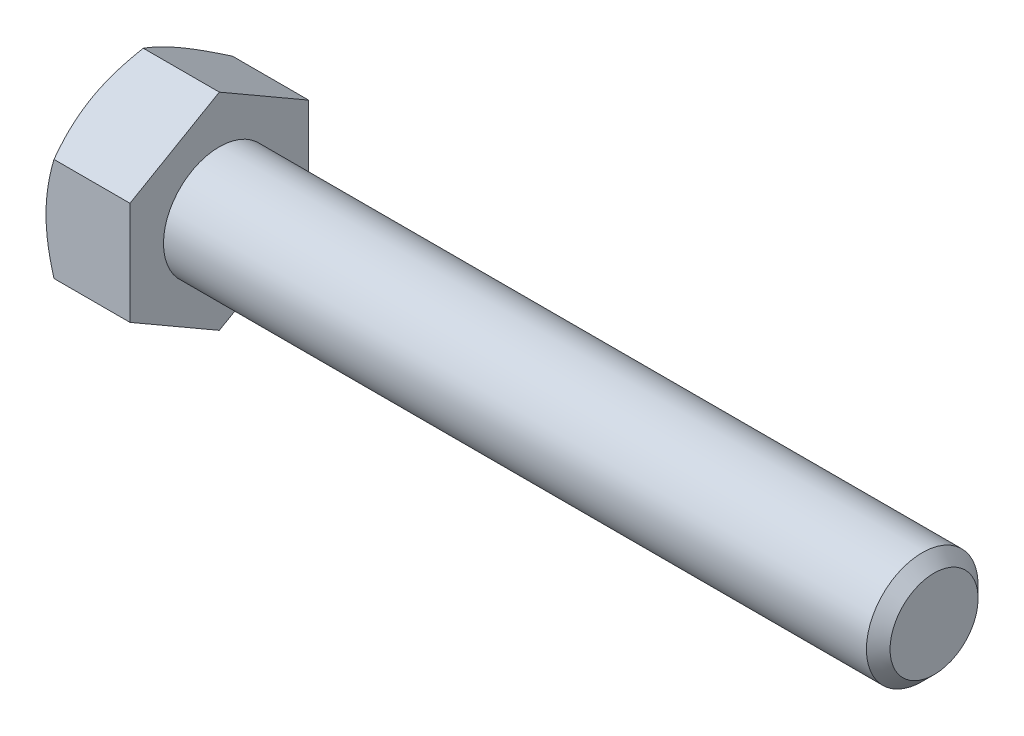
ISO-10303-21;
HEADER;
FILE_DESCRIPTION(('STEP AP214'),'2;1');
FILE_NAME('part.step','',(''),(''),'','','');
FILE_SCHEMA(('AUTOMOTIVE_DESIGN { 1 0 10303 214 1 1 1 1 }'));
ENDSEC;
DATA;
#1=APPLICATION_CONTEXT('core data for automotive mechanical design processes');
#2=APPLICATION_PROTOCOL_DEFINITION('international standard','automotive_design',2000,#1);
#3=PRODUCT_CONTEXT('',#1,'mechanical');
#4=PRODUCT('Part','Part','',(#3));
#5=PRODUCT_RELATED_PRODUCT_CATEGORY('part','',(#4));
#6=PRODUCT_DEFINITION_FORMATION('','',#4);
#7=PRODUCT_DEFINITION_CONTEXT('part definition',#1,'design');
#8=PRODUCT_DEFINITION('design','',#6,#7);
#9=PRODUCT_DEFINITION_SHAPE('','',#8);
#10=(LENGTH_UNIT() NAMED_UNIT(*) SI_UNIT(.MILLI.,.METRE.));
#11=(NAMED_UNIT(*) PLANE_ANGLE_UNIT() SI_UNIT($,.RADIAN.));
#12=(NAMED_UNIT(*) SI_UNIT($,.STERADIAN.) SOLID_ANGLE_UNIT());
#13=UNCERTAINTY_MEASURE_WITH_UNIT(LENGTH_MEASURE(1.E-05),#10,'distance_accuracy_value','');
#14=(GEOMETRIC_REPRESENTATION_CONTEXT(3) GLOBAL_UNCERTAINTY_ASSIGNED_CONTEXT((#13)) GLOBAL_UNIT_ASSIGNED_CONTEXT((#10,
#11,#12)) REPRESENTATION_CONTEXT('',''));
#15=CARTESIAN_POINT('',(0.,0.,0.));
#16=DIRECTION('',(0.,0.,1.));
#17=DIRECTION('',(1.,0.,0.));
#18=AXIS2_PLACEMENT_3D('',#15,#16,#17);
#19=CARTESIAN_POINT('',(5.969,3.66617420935412,-6.35));
#20=DIRECTION('',(0.,-0.866025403784438,0.500000000000001));
#21=DIRECTION('',(0.,-0.500000000000001,-0.866025403784438));
#22=AXIS2_PLACEMENT_3D('',#19,#20,#21);
#23=PLANE('',#22);
#24=CARTESIAN_POINT('',(0.567225792220654,7.33246388876209,0.0002));
#25=CARTESIAN_POINT('',(0.520705795885485,7.25187715009445,-0.13938032578862));
#26=CARTESIAN_POINT('',(0.476297032585866,7.17098994497989,-0.279481074729296));
#27=CARTESIAN_POINT('',(0.392283450452391,7.00855864282177,-0.560820342806735));
#28=CARTESIAN_POINT('',(0.352680703976119,6.92701427845871,-0.70205932495446));
#29=CARTESIAN_POINT('',(0.241858823809872,6.68107555195828,-1.12803769480199));
#30=CARTESIAN_POINT('',(0.178824482202448,6.51571038378533,-1.41445856787971));
#31=CARTESIAN_POINT('',(0.104909071695575,6.26824441683674,-1.84308219577883));
#32=CARTESIAN_POINT('',(0.0838526679332037,6.18688302502749,-1.98400426016695));
#33=CARTESIAN_POINT('',(0.0485440446617525,6.02379260806586,-2.26648514857209));
#34=CARTESIAN_POINT('',(0.0342912239672217,5.94206361604021,-2.40804391521192));
#35=CARTESIAN_POINT('',(0.0129530042780838,5.77846368249352,-2.69140731222967));
#36=CARTESIAN_POINT('',(0.00585947102329099,5.69659300817866,-2.83321147979293));
#37=CARTESIAN_POINT('',(-0.00101567917148045,5.53278054688489,-3.11694298566665));
#38=CARTESIAN_POINT('',(-0.00079752198907783,5.45083876218098,-3.2588703200367));
#39=CARTESIAN_POINT('',(0.00985057652705702,5.22634399461133,-3.64770666350069));
#40=CARTESIAN_POINT('',(0.0277266404085345,5.08386449580427,-3.89448839447147));
#41=CARTESIAN_POINT('',(0.0844122058574276,4.79985183690218,-4.38641274968262));
#42=CARTESIAN_POINT('',(0.123241082865868,4.65831967566048,-4.63155364385826));
#43=CARTESIAN_POINT('',(0.220302170250009,4.37373542545027,-5.12446802425625));
#44=CARTESIAN_POINT('',(0.27894562495932,4.23071924628532,-5.37217931287431));
#45=CARTESIAN_POINT('',(0.412042668710684,3.94681968285055,-5.86390778098997));
#46=CARTESIAN_POINT('',(0.486464993107681,3.8059326626677,-6.10793125807364));
#47=CARTESIAN_POINT('',(0.56722579222065,3.66605873930028,-6.3502));
#48=B_SPLINE_CURVE_WITH_KNOTS('',3,(#24,#25,#26,#27,#28,#29,#30,#31,#32,#33,#34,#35,#36,#37,#38,
#39,#40,#41,#42,#43,#44,#45,#46,#47),.UNSPECIFIED.,.F.,.F.,(4,2,2,2,2,2,2,2,2,2,2,4),(0.,
0.503218195050233,1.00665261286994,2.01561339063536,2.50773694105499,2.99981699787609,
3.49133733019735,3.9828424781586,4.83850206575152,5.69495425638523,6.57040160519865,
7.44413026658513),.UNSPECIFIED.);
#49=CARTESIAN_POINT('',(0.567159123979209,7.33234841870825,0.));
#50=VERTEX_POINT('',#49);
#51=CARTESIAN_POINT('',(0.,5.49926131403118,-3.17500000000001));
#52=VERTEX_POINT('',#51);
#53=EDGE_CURVE('E53',#50,#52,#48,.T.);
#54=ORIENTED_EDGE('',*,*,#53,.F.);
#55=DIRECTION('',(-1.,0.,0.));
#56=VECTOR('',#55,1.);
#57=CARTESIAN_POINT('',(5.969,7.33234841870825,0.));
#58=LINE('',#57,#56);
#59=CARTESIAN_POINT('',(5.969,7.33234841870825,0.));
#60=VERTEX_POINT('',#59);
#61=EDGE_CURVE('E149',#60,#50,#58,.T.);
#62=ORIENTED_EDGE('',*,*,#61,.F.);
#63=DIRECTION('',(0.,0.500000000000001,0.866025403784438));
#64=VECTOR('',#63,1.);
#65=CARTESIAN_POINT('',(5.969,3.66617420935412,-6.35));
#66=LINE('',#65,#64);
#67=CARTESIAN_POINT('',(5.969,3.66617420935412,-6.35));
#68=VERTEX_POINT('',#67);
#69=EDGE_CURVE('E240',#68,#60,#66,.T.);
#70=ORIENTED_EDGE('',*,*,#69,.F.);
#71=DIRECTION('',(-1.,0.,0.));
#72=VECTOR('',#71,1.);
#73=CARTESIAN_POINT('',(5.969,3.66617420935412,-6.35));
#74=LINE('',#73,#72);
#75=CARTESIAN_POINT('',(0.567159123979205,3.66617420935412,-6.35));
#76=VERTEX_POINT('',#75);
#77=EDGE_CURVE('E137',#68,#76,#74,.T.);
#78=ORIENTED_EDGE('',*,*,#77,.T.);
#79=EDGE_CURVE('E131',#52,#76,#48,.T.);
#80=ORIENTED_EDGE('',*,*,#79,.F.);
#81=EDGE_LOOP('',(#54,#62,#70,#78,#80));
#82=FACE_BOUND('',#81,.T.);
#83=ADVANCED_FACE('F37',(#82),#23,.F.);
#84=CARTESIAN_POINT('',(5.969,7.33234841870825,0.));
#85=DIRECTION('',(0.,-0.866025403784438,-0.500000000000001));
#86=DIRECTION('',(0.,0.500000000000001,-0.866025403784438));
#87=AXIS2_PLACEMENT_3D('',#84,#85,#86);
#88=PLANE('',#87);
#89=CARTESIAN_POINT('',(0.567225792220651,3.66605873930028,6.3502));
#90=CARTESIAN_POINT('',(0.520705795885481,3.74664547796792,6.21061967421138));
#91=CARTESIAN_POINT('',(0.476297032585863,3.82753268308249,6.07051892527071));
#92=CARTESIAN_POINT('',(0.392283450452387,3.98996398524061,5.78917965719326));
#93=CARTESIAN_POINT('',(0.352680703976116,4.07150834960367,5.64794067504554));
#94=CARTESIAN_POINT('',(0.24185882380987,4.3174470761041,5.22196230519801));
#95=CARTESIAN_POINT('',(0.178824482202446,4.48281224427705,4.93554143212029));
#96=CARTESIAN_POINT('',(0.104909071695574,4.73027821122564,4.50691780422117));
#97=CARTESIAN_POINT('',(0.0838526679332021,4.81163960303488,4.36599573983305));
#98=CARTESIAN_POINT('',(0.0485440446617516,4.97473001999651,4.08351485142791));
#99=CARTESIAN_POINT('',(0.0342912239672211,5.05645901202216,3.94195608478808));
#100=CARTESIAN_POINT('',(0.0129530042780836,5.22005894556885,3.65859268777034));
#101=CARTESIAN_POINT('',(0.00585947102329081,5.30192961988371,3.51678852020707));
#102=CARTESIAN_POINT('',(-0.00101567917148027,5.46574208117748,3.23305701433335));
#103=CARTESIAN_POINT('',(-0.000797521989077335,5.5476838658814,3.0911296799633));
#104=CARTESIAN_POINT('',(0.00985057652705823,5.77217863345104,2.70229333649931));
#105=CARTESIAN_POINT('',(0.027726640408536,5.9146581322581,2.45551160552853));
#106=CARTESIAN_POINT('',(0.0844122058574296,6.19867079116019,1.96358725031738));
#107=CARTESIAN_POINT('',(0.12324108286587,6.34020295240189,1.71844635614174));
#108=CARTESIAN_POINT('',(0.220302170250012,6.6247872026121,1.22553197574375));
#109=CARTESIAN_POINT('',(0.278945624959323,6.76780338177705,0.977820687125687));
#110=CARTESIAN_POINT('',(0.412042668710688,7.05170294521183,0.486092219010035));
#111=CARTESIAN_POINT('',(0.486464993107684,7.19258996539468,0.242068741926357));
#112=CARTESIAN_POINT('',(0.567225792220654,7.33246388876209,-0.000199999999999491));
#113=B_SPLINE_CURVE_WITH_KNOTS('',3,(#89,#90,#91,#92,#93,#94,#95,#96,#97,#98,#99,#100,#101,#102,
#103,#104,#105,#106,#107,#108,#109,#110,#111,#112),.UNSPECIFIED.,.F.,.F.,(4,2,2,2,2,2,2,2,2,2,2,
4),(0.,0.503218195050231,1.00665261286994,2.01561339063536,2.50773694105499,2.99981699787608,
3.49133733019735,3.9828424781586,4.83850206575152,5.69495425638523,6.57040160519864,
7.44413026658513),.UNSPECIFIED.);
#114=CARTESIAN_POINT('',(0.567159123979206,3.66617420935412,6.35));
#115=VERTEX_POINT('',#114);
#116=CARTESIAN_POINT('',(0.,5.49926131403118,3.17500000000001));
#117=VERTEX_POINT('',#116);
#118=EDGE_CURVE('E60',#115,#117,#113,.T.);
#119=ORIENTED_EDGE('',*,*,#118,.F.);
#120=DIRECTION('',(-1.,0.,0.));
#121=VECTOR('',#120,1.);
#122=CARTESIAN_POINT('',(5.969,3.66617420935412,6.35));
#123=LINE('',#122,#121);
#124=CARTESIAN_POINT('',(5.969,3.66617420935412,6.35));
#125=VERTEX_POINT('',#124);
#126=EDGE_CURVE('E147',#125,#115,#123,.T.);
#127=ORIENTED_EDGE('',*,*,#126,.F.);
#128=DIRECTION('',(0.,-0.500000000000001,0.866025403784438));
#129=VECTOR('',#128,1.);
#130=CARTESIAN_POINT('',(5.969,7.33234841870825,0.));
#131=LINE('',#130,#129);
#132=EDGE_CURVE('E238',#60,#125,#131,.T.);
#133=ORIENTED_EDGE('',*,*,#132,.F.);
#134=ORIENTED_EDGE('',*,*,#61,.T.);
#135=EDGE_CURVE('E164',#117,#50,#113,.T.);
#136=ORIENTED_EDGE('',*,*,#135,.F.);
#137=EDGE_LOOP('',(#119,#127,#133,#134,#136));
#138=FACE_BOUND('',#137,.T.);
#139=ADVANCED_FACE('F170',(#138),#88,.F.);
#140=CARTESIAN_POINT('',(5.969,3.66617420935412,6.35));
#141=DIRECTION('',(0.,0.,-1.));
#142=DIRECTION('',(-1.,0.,0.));
#143=AXIS2_PLACEMENT_3D('',#140,#141,#142);
#144=PLANE('',#143);
#145=CARTESIAN_POINT('',(3.14367601755406,-9.93980283198641,6.35));
#146=CARTESIAN_POINT('',(3.00837198029773,-9.66163438687444,6.35));
#147=CARTESIAN_POINT('',(2.8743390802731,-9.38283710730512,6.35));
#148=CARTESIAN_POINT('',(2.60952879037524,-8.82365074911732,6.35));
#149=CARTESIAN_POINT('',(2.47875189635371,-8.54326143593899,6.35));
#150=CARTESIAN_POINT('',(2.2205286877213,-7.97915634696429,6.35));
#151=CARTESIAN_POINT('',(2.0931035918635,-7.69543082522701,6.35));
#152=CARTESIAN_POINT('',(1.84334767414879,-7.1257546537977,6.35));
#153=CARTESIAN_POINT('',(1.7210166174491,-6.83980410740555,6.35));
#154=CARTESIAN_POINT('',(1.47885197386772,-6.25572302707622,6.35));
#155=CARTESIAN_POINT('',(1.35923464654654,-5.95750234981811,6.35));
#156=CARTESIAN_POINT('',(1.12883238942456,-5.35760609479501,6.35));
#157=CARTESIAN_POINT('',(1.01804843752939,-5.05593013872693,6.35));
#158=CARTESIAN_POINT('',(0.80815309825523,-4.44917964545298,6.35));
#159=CARTESIAN_POINT('',(0.709018875842448,-4.14411308466492,6.35));
#160=CARTESIAN_POINT('',(0.525543834192888,-3.52960171995186,6.35));
#161=CARTESIAN_POINT('',(0.44119845359094,-3.22015829792944,6.35));
#162=CARTESIAN_POINT('',(0.291727586386878,-2.59842911342063,6.35));
#163=CARTESIAN_POINT('',(0.226496888329711,-2.28616904994311,6.35));
#164=CARTESIAN_POINT('',(0.118904571828103,-1.65762730788837,6.35));
#165=CARTESIAN_POINT('',(0.0765405573459605,-1.34134605421932,6.35));
#166=CARTESIAN_POINT('',(0.0329533459299359,-0.867275016888795,6.35));
#167=CARTESIAN_POINT('',(0.0217606490874795,-0.710363798925244,6.35));
#168=CARTESIAN_POINT('',(0.00601970866108334,-0.396201526465932,6.35));
#169=CARTESIAN_POINT('',(0.00147135206033235,-0.238950477796082,6.35));
#170=CARTESIAN_POINT('',(-0.000864873693704527,0.0756024820110037,6.35));
#171=CARTESIAN_POINT('',(0.00134730804231402,0.232904393522192,6.35));
#172=CARTESIAN_POINT('',(0.0124750937047342,0.547273259965602,6.35));
#173=CARTESIAN_POINT('',(0.0213910154873181,0.704340203403029,6.35));
#174=CARTESIAN_POINT('',(0.0504634057547389,1.07899586027898,6.35));
#175=CARTESIAN_POINT('',(0.0736436238822164,1.29635509573769,6.35));
#176=CARTESIAN_POINT('',(0.131599604348193,1.72951065205877,6.35));
#177=CARTESIAN_POINT('',(0.166376861833685,1.94530676772893,6.35));
#178=CARTESIAN_POINT('',(0.286264257854854,2.59006925980296,6.35));
#179=CARTESIAN_POINT('',(0.386910475193505,3.01618787228097,6.35));
#180=CARTESIAN_POINT('',(0.562116784628248,3.65361272982343,6.35));
#181=CARTESIAN_POINT('',(0.625415304913835,3.8682048403254,6.35));
#182=CARTESIAN_POINT('',(0.758751353425596,4.29530575657377,6.35));
#183=CARTESIAN_POINT('',(0.828788931820654,4.50781454679791,6.35));
#184=CARTESIAN_POINT('',(0.974465563814953,4.93081468737567,6.35));
#185=CARTESIAN_POINT('',(1.05010294252175,5.14130661986482,6.35));
#186=CARTESIAN_POINT('',(1.20607264760708,5.56053331579617,6.35));
#187=CARTESIAN_POINT('',(1.28640487799369,5.76926811506531,6.35));
#188=CARTESIAN_POINT('',(1.50347781751131,6.3178382834451,6.35));
#189=CARTESIAN_POINT('',(1.64351404320344,6.65636817400483,6.35));
#190=CARTESIAN_POINT('',(1.93147973510731,7.33006601753895,6.35));
#191=CARTESIAN_POINT('',(2.07940998438118,7.66523363305401,6.35));
#192=CARTESIAN_POINT('',(2.38134633815376,8.3329524611488,6.35));
#193=CARTESIAN_POINT('',(2.53535453751782,8.66550272340175,6.35));
#194=CARTESIAN_POINT('',(2.84803388547347,9.32838207907314,6.35));
#195=CARTESIAN_POINT('',(3.00670486567662,9.65871125217435,6.35));
#196=CARTESIAN_POINT('',(3.32795966755859,10.3180684957328,6.35));
#197=CARTESIAN_POINT('',(3.49054898052716,10.6470938852597,6.35));
#198=CARTESIAN_POINT('',(3.81866781799734,11.3036759425,6.35));
#199=CARTESIAN_POINT('',(3.98419736411603,11.6312325993928,6.35));
#200=CARTESIAN_POINT('',(4.31759864974134,12.2850676249535,6.35));
#201=CARTESIAN_POINT('',(4.485469913239,12.6113462366288,6.35));
#202=CARTESIAN_POINT('',(4.82315890277016,13.2628952011191,6.35));
#203=CARTESIAN_POINT('',(4.99297663652367,13.5881655499287,6.35));
#204=CARTESIAN_POINT('',(5.47018031685674,14.4967378639502,6.35));
#205=CARTESIAN_POINT('',(5.77935148177737,15.0791020152927,6.35));
#206=CARTESIAN_POINT('',(6.40147296847068,16.2418453877031,6.35));
#207=CARTESIAN_POINT('',(6.71442349983112,16.8222244963774,6.35));
#208=CARTESIAN_POINT('',(7.34215184678353,17.9796171047036,6.35));
#209=CARTESIAN_POINT('',(7.65692074956547,18.5566354431591,6.35));
#210=CARTESIAN_POINT('',(8.28862904640649,19.7094283212459,6.35));
#211=CARTESIAN_POINT('',(8.60556827976313,20.2852029489025,6.35));
#212=CARTESIAN_POINT('',(8.92329906980365,20.8605372016132,6.35));
#213=B_SPLINE_CURVE_WITH_KNOTS('',3,(#145,#146,#147,#148,#149,#150,#151,#152,#153,#154,#155,
#156,#157,#158,#159,#160,#161,#162,#163,#164,#165,#166,#167,#168,#169,#170,#171,#172,#173,#174,
#175,#176,#177,#178,#179,#180,#181,#182,#183,#184,#185,#186,#187,#188,#189,#190,#191,#192,#193,
#194,#195,#196,#197,#198,#199,#200,#201,#202,#203,#204,#205,#206,#207,#208,#209,#210,#211,#212),
.UNSPECIFIED.,.F.,.F.,(4,2,2,2,2,2,2,2,2,2,2,2,2,2,2,2,2,2,2,2,2,2,2,2,2,2,2,2,2,2,2,2,2,4),(0.,
0.928000025771649,1.85614052122796,2.78917912474405,3.72217466606163,4.68601414241723,
5.64996017364175,6.61198406033348,7.57371070325734,8.53003982946588,9.48626872926093,
9.95807916799838,10.4298815813894,10.9016875462366,11.3735158830582,12.0289230702765,
12.6844147884824,13.9960635141582,14.6672040909619,15.338349664455,16.0092953039748,
16.6802272299963,17.7791313314936,18.8781446441682,19.9775401158916,21.0768959334804,
22.1778940812193,23.2789003270287,24.379685937715,25.480475915801,27.4584871219283,
29.4366085285952,31.408472007269,33.380191024666),.UNSPECIFIED.);
#214=CARTESIAN_POINT('',(0.567159123979207,-3.66617420935413,6.35));
#215=VERTEX_POINT('',#214);
#216=CARTESIAN_POINT('',(0.,0.,6.35));
#217=VERTEX_POINT('',#216);
#218=EDGE_CURVE('E250',#215,#217,#213,.T.);
#219=ORIENTED_EDGE('',*,*,#218,.F.);
#220=DIRECTION('',(-1.,0.,0.));
#221=VECTOR('',#220,1.);
#222=CARTESIAN_POINT('',(5.969,-3.66617420935413,6.35));
#223=LINE('',#222,#221);
#224=CARTESIAN_POINT('',(5.969,-3.66617420935413,6.35));
#225=VERTEX_POINT('',#224);
#226=EDGE_CURVE('E139',#225,#215,#223,.T.);
#227=ORIENTED_EDGE('',*,*,#226,.F.);
#228=DIRECTION('',(0.,-1.,0.));
#229=VECTOR('',#228,1.);
#230=CARTESIAN_POINT('',(5.969,3.66617420935412,6.35));
#231=LINE('',#230,#229);
#232=EDGE_CURVE('E234',#125,#225,#231,.T.);
#233=ORIENTED_EDGE('',*,*,#232,.F.);
#234=ORIENTED_EDGE('',*,*,#126,.T.);
#235=EDGE_CURVE('E188',#217,#115,#213,.T.);
#236=ORIENTED_EDGE('',*,*,#235,.F.);
#237=EDGE_LOOP('',(#219,#227,#233,#234,#236));
#238=FACE_BOUND('',#237,.T.);
#239=ADVANCED_FACE('F256',(#238),#144,.F.);
#240=CARTESIAN_POINT('',(5.969,-7.33234841870826,0.));
#241=DIRECTION('',(0.,0.866025403784438,-0.500000000000001));
#242=DIRECTION('',(0.,0.500000000000001,0.866025403784438));
#243=AXIS2_PLACEMENT_3D('',#240,#241,#242);
#244=PLANE('',#243);
#245=CARTESIAN_POINT('',(0.567225792220661,-7.3324638887621,-0.00020000000000005));
#246=CARTESIAN_POINT('',(0.520705795885491,-7.25187715009447,0.13938032578862));
#247=CARTESIAN_POINT('',(0.476297032585872,-7.1709899449799,0.279481074729296));
#248=CARTESIAN_POINT('',(0.392283450452397,-7.00855864282178,0.560820342806736));
#249=CARTESIAN_POINT('',(0.352680703976125,-6.92701427845872,0.702059324954461));
#250=CARTESIAN_POINT('',(0.241858823809878,-6.68107555195829,1.12803769480199));
#251=CARTESIAN_POINT('',(0.178824482202453,-6.51571038378534,1.41445856787971));
#252=CARTESIAN_POINT('',(0.10490907169558,-6.26824441683675,1.84308219577883));
#253=CARTESIAN_POINT('',(0.0838526679332088,-6.1868830250275,1.98400426016696));
#254=CARTESIAN_POINT('',(0.0485440446617578,-6.02379260806587,2.26648514857209));
#255=CARTESIAN_POINT('',(0.0342912239672271,-5.94206361604022,2.40804391521192));
#256=CARTESIAN_POINT('',(0.0129530042780889,-5.77846368249353,2.69140731222967));
#257=CARTESIAN_POINT('',(0.00585947102329567,-5.69659300817867,2.83321147979293));
#258=CARTESIAN_POINT('',(-0.00101567917147586,-5.5327805468849,3.11694298566665));
#259=CARTESIAN_POINT('',(-0.000797521989072936,-5.45083876218098,3.25887032003671));
#260=CARTESIAN_POINT('',(0.00985057652706222,-5.22634399461134,3.6477066635007));
#261=CARTESIAN_POINT('',(0.0277266404085393,-5.08386449580428,3.89448839447147));
#262=CARTESIAN_POINT('',(0.084412205857432,-4.79985183690218,4.38641274968263));
#263=CARTESIAN_POINT('',(0.123241082865872,-4.65831967566049,4.63155364385827));
#264=CARTESIAN_POINT('',(0.220302170250013,-4.37373542545028,5.12446802425625));
#265=CARTESIAN_POINT('',(0.278945624959323,-4.23071924628533,5.37217931287431));
#266=CARTESIAN_POINT('',(0.412042668710687,-3.94681968285055,5.86390778098997));
#267=CARTESIAN_POINT('',(0.486464993107684,-3.80593266266771,6.10793125807364));
#268=CARTESIAN_POINT('',(0.567225792220652,-3.66605873930029,6.3502));
#269=B_SPLINE_CURVE_WITH_KNOTS('',3,(#245,#246,#247,#248,#249,#250,#251,#252,#253,#254,#255,
#256,#257,#258,#259,#260,#261,#262,#263,#264,#265,#266,#267,#268),.UNSPECIFIED.,.F.,.F.,(4,2,2,
2,2,2,2,2,2,2,2,4),(0.,0.503218195050233,1.00665261286994,2.01561339063537,2.507736941055,
2.99981699787609,3.49133733019736,3.98284247815861,4.83850206575153,5.69495425638523,
6.57040160519865,7.44413026658513),.UNSPECIFIED.);
#270=CARTESIAN_POINT('',(0.567159123979216,-7.33234841870826,0.));
#271=VERTEX_POINT('',#270);
#272=CARTESIAN_POINT('',(0.,-5.49926131403118,3.17500000000001));
#273=VERTEX_POINT('',#272);
#274=EDGE_CURVE('E172',#271,#273,#269,.T.);
#275=ORIENTED_EDGE('',*,*,#274,.F.);
#276=DIRECTION('',(-1.,0.,0.));
#277=VECTOR('',#276,1.);
#278=CARTESIAN_POINT('',(5.969,-7.33234841870826,0.));
#279=LINE('',#278,#277);
#280=CARTESIAN_POINT('',(5.969,-7.33234841870826,0.));
#281=VERTEX_POINT('',#280);
#282=EDGE_CURVE('E136',#281,#271,#279,.T.);
#283=ORIENTED_EDGE('',*,*,#282,.F.);
#284=DIRECTION('',(0.,-0.500000000000001,-0.866025403784438));
#285=VECTOR('',#284,1.);
#286=CARTESIAN_POINT('',(5.969,-7.33234841870826,0.));
#287=LINE('',#286,#285);
#288=EDGE_CURVE('E232',#225,#281,#287,.T.);
#289=ORIENTED_EDGE('',*,*,#288,.F.);
#290=ORIENTED_EDGE('',*,*,#226,.T.);
#291=EDGE_CURVE('E174',#273,#215,#269,.T.);
#292=ORIENTED_EDGE('',*,*,#291,.F.);
#293=EDGE_LOOP('',(#275,#283,#289,#290,#292));
#294=FACE_BOUND('',#293,.T.);
#295=ADVANCED_FACE('F228',(#294),#244,.F.);
#296=CARTESIAN_POINT('',(5.969,-3.66617420935413,-6.35));
#297=DIRECTION('',(0.,0.866025403784438,0.500000000000001));
#298=DIRECTION('',(0.,-0.500000000000001,0.866025403784438));
#299=AXIS2_PLACEMENT_3D('',#296,#297,#298);
#300=PLANE('',#299);
#301=CARTESIAN_POINT('',(0.567225792220654,-3.66605873930029,-6.3502));
#302=CARTESIAN_POINT('',(0.520705795885485,-3.74664547796793,-6.21061967421138));
#303=CARTESIAN_POINT('',(0.476297032585867,-3.8275326830825,-6.0705189252707));
#304=CARTESIAN_POINT('',(0.392283450452391,-3.98996398524062,-5.78917965719326));
#305=CARTESIAN_POINT('',(0.35268070397612,-4.07150834960368,-5.64794067504554));
#306=CARTESIAN_POINT('',(0.241858823809874,-4.31744707610411,-5.22196230519801));
#307=CARTESIAN_POINT('',(0.17882448220245,-4.48281224427706,-4.93554143212029));
#308=CARTESIAN_POINT('',(0.104909071695578,-4.73027821122565,-4.50691780422117));
#309=CARTESIAN_POINT('',(0.0838526679332073,-4.81163960303489,-4.36599573983304));
#310=CARTESIAN_POINT('',(0.0485440446617569,-4.97473001999652,-4.08351485142791));
#311=CARTESIAN_POINT('',(0.0342912239672263,-5.05645901202218,-3.94195608478808));
#312=CARTESIAN_POINT('',(0.0129530042780887,-5.22005894556886,-3.65859268777033));
#313=CARTESIAN_POINT('',(0.005859471023296,-5.30192961988372,-3.51678852020707));
#314=CARTESIAN_POINT('',(-0.0010156791714747,-5.46574208117749,-3.23305701433335));
#315=CARTESIAN_POINT('',(-0.000797521989071448,-5.54768386588141,-3.0911296799633));
#316=CARTESIAN_POINT('',(0.00985057652706477,-5.77217863345105,-2.7022933364993));
#317=CARTESIAN_POINT('',(0.0277266404085427,-5.91465813225811,-2.45551160552853));
#318=CARTESIAN_POINT('',(0.0844122058574362,-6.19867079116021,-1.96358725031738));
#319=CARTESIAN_POINT('',(0.123241082865877,-6.3402029524019,-1.71844635614174));
#320=CARTESIAN_POINT('',(0.220302170250018,-6.62478720261212,-1.22553197574375));
#321=CARTESIAN_POINT('',(0.278945624959329,-6.76780338177706,-0.977820687125686));
#322=CARTESIAN_POINT('',(0.412042668710695,-7.05170294521184,-0.486092219010034));
#323=CARTESIAN_POINT('',(0.486464993107691,-7.19258996539469,-0.242068741926357));
#324=CARTESIAN_POINT('',(0.56722579222066,-7.3324638887621,0.000199999999999858));
#325=B_SPLINE_CURVE_WITH_KNOTS('',3,(#301,#302,#303,#304,#305,#306,#307,#308,#309,#310,#311,
#312,#313,#314,#315,#316,#317,#318,#319,#320,#321,#322,#323,#324),.UNSPECIFIED.,.F.,.F.,(4,2,2,
2,2,2,2,2,2,2,2,4),(0.,0.503218195050233,1.00665261286994,2.01561339063537,2.507736941055,
2.99981699787609,3.49133733019735,3.98284247815861,4.83850206575153,5.69495425638523,
6.57040160519865,7.44413026658513),.UNSPECIFIED.);
#326=CARTESIAN_POINT('',(0.567159123978886,-3.66617420935462,-6.35));
#327=VERTEX_POINT('',#326);
#328=CARTESIAN_POINT('',(0.,-5.49926131403118,-3.175));
#329=VERTEX_POINT('',#328);
#330=EDGE_CURVE('E113',#327,#329,#325,.T.);
#331=ORIENTED_EDGE('',*,*,#330,.F.);
#332=DIRECTION('',(-1.,0.,0.));
#333=VECTOR('',#332,1.);
#334=CARTESIAN_POINT('',(5.969,-3.66617420935413,-6.35));
#335=LINE('',#334,#333);
#336=CARTESIAN_POINT('',(5.969,-3.66617420935413,-6.35));
#337=VERTEX_POINT('',#336);
#338=EDGE_CURVE('E127',#337,#327,#335,.T.);
#339=ORIENTED_EDGE('',*,*,#338,.F.);
#340=DIRECTION('',(0.,0.500000000000001,-0.866025403784438));
#341=VECTOR('',#340,1.);
#342=CARTESIAN_POINT('',(5.969,-3.66617420935413,-6.35));
#343=LINE('',#342,#341);
#344=EDGE_CURVE('E230',#281,#337,#343,.T.);
#345=ORIENTED_EDGE('',*,*,#344,.F.);
#346=ORIENTED_EDGE('',*,*,#282,.T.);
#347=EDGE_CURVE('E130',#329,#271,#325,.T.);
#348=ORIENTED_EDGE('',*,*,#347,.F.);
#349=EDGE_LOOP('',(#331,#339,#345,#346,#348));
#350=FACE_BOUND('',#349,.T.);
#351=ADVANCED_FACE('F125',(#350),#300,.F.);
#352=CARTESIAN_POINT('',(5.969,3.66617420935412,-6.35));
#353=DIRECTION('',(0.,0.,1.));
#354=DIRECTION('',(0.,-1.,0.));
#355=AXIS2_PLACEMENT_3D('',#352,#353,#354);
#356=PLANE('',#355);
#357=CARTESIAN_POINT('',(3.14367601861733,-9.93980283417178,-6.35));
#358=CARTESIAN_POINT('',(3.00837198131662,-9.66163438898628,-6.35));
#359=CARTESIAN_POINT('',(2.87433908124762,-9.38283710934337,-6.35));
#360=CARTESIAN_POINT('',(2.60952879126125,-8.82365075100816,-6.35));
#361=CARTESIAN_POINT('',(2.47875189719557,-8.54326143775602,-6.35));
#362=CARTESIAN_POINT('',(2.22052868847483,-7.97915634863256,-6.35));
#363=CARTESIAN_POINT('',(2.09310359257287,-7.69543082682034,-6.35));
#364=CARTESIAN_POINT('',(1.84334767477056,-7.12575465524061,-6.35));
#365=CARTESIAN_POINT('',(1.72101661802742,-6.839804108773,-6.35));
#366=CARTESIAN_POINT('',(1.47885197435795,-6.25572302828697,-6.35));
#367=CARTESIAN_POINT('',(1.35923464699221,-5.95750235094756,-6.35));
#368=CARTESIAN_POINT('',(1.12883238978351,-5.35760609576057,-6.35));
#369=CARTESIAN_POINT('',(1.01804843784616,-5.05593013960988,-6.35));
#370=CARTESIAN_POINT('',(0.808153098491683,-4.44917964616919,-6.35));
#371=CARTESIAN_POINT('',(0.709018876040749,-4.144113085297,-6.35));
#372=CARTESIAN_POINT('',(0.525543834321113,-3.52960172041338,-6.35));
#373=CARTESIAN_POINT('',(0.441198453687238,-3.22015829830454,-6.35));
#374=CARTESIAN_POINT('',(0.291727586418749,-2.59842911357849,-6.35));
#375=CARTESIAN_POINT('',(0.226496888331555,-2.28616904996955,-6.35));
#376=CARTESIAN_POINT('',(0.11890457178976,-1.65762730764876,-6.35));
#377=CARTESIAN_POINT('',(0.0765405572974408,-1.34134605384507,-6.35));
#378=CARTESIAN_POINT('',(0.0329533458840343,-0.867275016313544,-6.35));
#379=CARTESIAN_POINT('',(0.0217606490453512,-0.710363798283964,-6.35));
#380=CARTESIAN_POINT('',(0.00601970863232378,-0.396201525692715,-6.35));
#381=CARTESIAN_POINT('',(0.00147135204116821,-0.238950476956957,-6.35));
#382=CARTESIAN_POINT('',(-0.000864873687976433,0.0756024829814501,-6.35));
#383=CARTESIAN_POINT('',(0.00134730806334,0.232904394558052,-6.35));
#384=CARTESIAN_POINT('',(0.0124750937616495,0.547273261131437,-6.35));
#385=CARTESIAN_POINT('',(0.0213910155648253,0.704340204633426,-6.35));
#386=CARTESIAN_POINT('',(0.0504634058828832,1.07899586160911,-6.35));
#387=CARTESIAN_POINT('',(0.0736436240395078,1.29635509710271,-6.35));
#388=CARTESIAN_POINT('',(0.131599604565339,1.72951065349199,-6.35));
#389=CARTESIAN_POINT('',(0.166376862081539,1.94530676919546,-6.35));
#390=CARTESIAN_POINT('',(0.286264258195476,2.59006926136761,-6.35));
#391=CARTESIAN_POINT('',(0.386910475596789,3.01618787390847,-6.35));
#392=CARTESIAN_POINT('',(0.562116785124007,3.65361273154496,-6.35));
#393=CARTESIAN_POINT('',(0.625415305440634,3.86820484207894,-6.35));
#394=CARTESIAN_POINT('',(0.758751354013528,4.29530575839097,-6.35));
#395=CARTESIAN_POINT('',(0.828788932438681,4.50781454864676,-6.35));
#396=CARTESIAN_POINT('',(0.974465564492096,4.93081468928759,-6.35));
#397=CARTESIAN_POINT('',(1.05010294322792,5.14130662180816,-6.35));
#398=CARTESIAN_POINT('',(1.20607264837028,5.56053331780235,-6.35));
#399=CARTESIAN_POINT('',(1.28640487878491,5.76926811710291,-6.35));
#400=CARTESIAN_POINT('',(1.50347781834975,6.31783828550132,-6.35));
#401=CARTESIAN_POINT('',(1.64351404405831,6.6563681760491,-6.35));
#402=CARTESIAN_POINT('',(1.93147973599044,7.33006601956083,-6.35));
#403=CARTESIAN_POINT('',(2.07940998527613,7.66523363506546,-6.35));
#404=CARTESIAN_POINT('',(2.38134633906898,8.33295246314048,-6.35));
#405=CARTESIAN_POINT('',(2.53535453844148,8.6655027253841,-6.35));
#406=CARTESIAN_POINT('',(2.84803388641161,9.32838208103783,-6.35));
#407=CARTESIAN_POINT('',(3.00670486662079,9.65871125413071,-6.35));
#408=CARTESIAN_POINT('',(3.32795966851281,10.3180684976728,-6.35));
#409=CARTESIAN_POINT('',(3.4905489814854,10.6470938871916,-6.35));
#410=CARTESIAN_POINT('',(3.81866781896227,11.3036759444164,-6.35));
#411=CARTESIAN_POINT('',(3.98419736508363,11.6312326013018,-6.35));
#412=CARTESIAN_POINT('',(4.3175986507133,12.2850676268482,-6.35));
#413=CARTESIAN_POINT('',(4.48546991421264,12.6113462385166,-6.35));
#414=CARTESIAN_POINT('',(4.82315890374639,13.2628952029935,-6.35));
#415=CARTESIAN_POINT('',(4.99297663750081,13.5881655517966,-6.35));
#416=CARTESIAN_POINT('',(5.47018031784122,14.4967378658111,-6.35));
#417=CARTESIAN_POINT('',(5.7793514827677,15.0791020171534,-6.35));
#418=CARTESIAN_POINT('',(6.40147296947151,16.241845389564,-6.35));
#419=CARTESIAN_POINT('',(6.71442350083661,16.8222244982386,-6.35));
#420=CARTESIAN_POINT('',(7.34215184779849,17.9796171065677,-6.35));
#421=CARTESIAN_POINT('',(7.65692075058526,18.5566354450257,-6.35));
#422=CARTESIAN_POINT('',(8.28862904743539,19.709428323118,-6.35));
#423=CARTESIAN_POINT('',(8.60556828079632,20.2852029507775,-6.35));
#424=CARTESIAN_POINT('',(8.92329907084094,20.8605372034912,-6.35));
#425=B_SPLINE_CURVE_WITH_KNOTS('',3,(#357,#358,#359,#360,#361,#362,#363,#364,#365,#366,#367,
#368,#369,#370,#371,#372,#373,#374,#375,#376,#377,#378,#379,#380,#381,#382,#383,#384,#385,#386,
#387,#388,#389,#390,#391,#392,#393,#394,#395,#396,#397,#398,#399,#400,#401,#402,#403,#404,#405,
#406,#407,#408,#409,#410,#411,#412,#413,#414,#415,#416,#417,#418,#419,#420,#421,#422,#423,#424),
.UNSPECIFIED.,.F.,.F.,(4,2,2,2,2,2,2,2,2,2,2,2,2,2,2,2,2,2,2,2,2,2,2,2,2,2,2,2,2,2,2,2,2,4),(0.,
0.928000026028283,1.85614052174127,2.78917912551676,3.72217466709373,4.68601414372541,
5.64996017522612,6.61198406219312,7.57371070539203,8.53003983200407,9.48626873220204,
9.9580791711361,10.4298815847237,10.9016875497677,11.373515886786,12.0289230741175,
12.6844147924368,13.9960635183396,14.6672040952618,15.3383496688733,16.0092953085113,
16.680227234651,17.7791313361342,18.8781446487945,19.9775401205032,21.0768959380774,
22.1778940858,23.2789003315931,24.3796859422634,25.4804759203333,27.4584871264683,
29.4366085331428,31.4084720118303,33.3801910292411),.UNSPECIFIED.);
#426=CARTESIAN_POINT('',(0.,0.,-6.35));
#427=VERTEX_POINT('',#426);
#428=EDGE_CURVE('E119',#76,#427,#425,.F.);
#429=ORIENTED_EDGE('',*,*,#428,.F.);
#430=ORIENTED_EDGE('',*,*,#77,.F.);
#431=DIRECTION('',(0.,1.,0.));
#432=VECTOR('',#431,1.);
#433=CARTESIAN_POINT('',(5.969,3.66617420935412,-6.35));
#434=LINE('',#433,#432);
#435=EDGE_CURVE('E135',#337,#68,#434,.T.);
#436=ORIENTED_EDGE('',*,*,#435,.F.);
#437=ORIENTED_EDGE('',*,*,#338,.T.);
#438=EDGE_CURVE('E110',#427,#327,#425,.F.);
#439=ORIENTED_EDGE('',*,*,#438,.F.);
#440=EDGE_LOOP('',(#429,#430,#436,#437,#439));
#441=FACE_BOUND('',#440,.T.);
#442=ADVANCED_FACE('F133',(#441),#356,.F.);
#443=CARTESIAN_POINT('',(5.969,7.33234841870825,0.));
#444=DIRECTION('',(1.,0.,0.));
#445=DIRECTION('',(0.,0.,-1.));
#446=AXIS2_PLACEMENT_3D('',#443,#444,#445);
#447=PLANE('',#446);
#448=CARTESIAN_POINT('',(5.969,0.,0.));
#449=DIRECTION('',(1.,0.,0.));
#450=DIRECTION('',(0.,0.,-1.));
#451=AXIS2_PLACEMENT_3D('',#448,#449,#450);
#452=CIRCLE('',#451,3.96875);
#453=CARTESIAN_POINT('',(5.969,0.,-3.96875));
#454=VERTEX_POINT('',#453);
#455=EDGE_CURVE('E243',#454,#454,#452,.F.);
#456=ORIENTED_EDGE('',*,*,#455,.T.);
#457=EDGE_LOOP('',(#456));
#458=FACE_BOUND('',#457,.T.);
#459=ORIENTED_EDGE('',*,*,#69,.T.);
#460=ORIENTED_EDGE('',*,*,#132,.T.);
#461=ORIENTED_EDGE('',*,*,#232,.T.);
#462=ORIENTED_EDGE('',*,*,#288,.T.);
#463=ORIENTED_EDGE('',*,*,#344,.T.);
#464=ORIENTED_EDGE('',*,*,#435,.T.);
#465=EDGE_LOOP('',(#459,#460,#461,#462,#463,#464));
#466=FACE_BOUND('',#465,.T.);
#467=ADVANCED_FACE('F258',(#458,#466),#447,.T.);
#468=CARTESIAN_POINT('',(0.,0.,0.));
#469=DIRECTION('',(-1.,0.,0.));
#470=DIRECTION('',(0.,0.,1.));
#471=AXIS2_PLACEMENT_3D('',#468,#469,#470);
#472=CYLINDRICAL_SURFACE('',#471,3.96875);
#473=ORIENTED_EDGE('',*,*,#455,.F.);
#474=EDGE_LOOP('',(#473));
#475=FACE_BOUND('',#474,.T.);
#476=CARTESIAN_POINT('',(55.92953,0.,0.));
#477=DIRECTION('',(-1.,0.,0.));
#478=DIRECTION('',(0.,0.,1.));
#479=AXIS2_PLACEMENT_3D('',#476,#477,#478);
#480=CIRCLE('',#479,3.96875);
#481=CARTESIAN_POINT('',(55.92953,0.,3.96875));
#482=VERTEX_POINT('',#481);
#483=EDGE_CURVE('E246',#482,#482,#480,.T.);
#484=ORIENTED_EDGE('',*,*,#483,.T.);
#485=EDGE_LOOP('',(#484));
#486=FACE_BOUND('',#485,.T.);
#487=ADVANCED_FACE('F289',(#475,#486),#472,.T.);
#488=CARTESIAN_POINT('',(56.769,0.,0.));
#489=DIRECTION('',(-1.,0.,0.));
#490=DIRECTION('',(0.,0.,1.));
#491=AXIS2_PLACEMENT_3D('',#488,#489,#490);
#492=CONICAL_SURFACE('',#491,3.12928,0.785398163397427);
#493=ORIENTED_EDGE('',*,*,#483,.F.);
#494=EDGE_LOOP('',(#493));
#495=FACE_BOUND('',#494,.T.);
#496=CARTESIAN_POINT('',(56.769,0.,0.));
#497=DIRECTION('',(-1.,0.,0.));
#498=DIRECTION('',(0.,0.,1.));
#499=AXIS2_PLACEMENT_3D('',#496,#497,#498);
#500=CIRCLE('',#499,3.12928);
#501=CARTESIAN_POINT('',(56.769,0.,3.12928));
#502=VERTEX_POINT('',#501);
#503=EDGE_CURVE('E248',#502,#502,#500,.T.);
#504=ORIENTED_EDGE('',*,*,#503,.T.);
#505=EDGE_LOOP('',(#504));
#506=FACE_BOUND('',#505,.T.);
#507=ADVANCED_FACE('F292',(#495,#506),#492,.T.);
#508=CARTESIAN_POINT('',(56.769,0.,0.));
#509=DIRECTION('',(-1.,0.,0.));
#510=DIRECTION('',(0.,0.,1.));
#511=AXIS2_PLACEMENT_3D('',#508,#509,#510);
#512=PLANE('',#511);
#513=ORIENTED_EDGE('',*,*,#503,.F.);
#514=EDGE_LOOP('',(#513));
#515=FACE_BOUND('',#514,.T.);
#516=ADVANCED_FACE('F202',(#515),#512,.F.);
#517=CARTESIAN_POINT('',(0.,0.,0.));
#518=DIRECTION('',(1.,0.,0.));
#519=DIRECTION('',(0.,0.,-1.));
#520=AXIS2_PLACEMENT_3D('',#517,#518,#519);
#521=CONICAL_SURFACE('',#520,6.35,1.0471975511966);
#522=ORIENTED_EDGE('',*,*,#330,.T.);
#523=CARTESIAN_POINT('',(0.,0.,0.));
#524=DIRECTION('',(1.,0.,0.));
#525=DIRECTION('',(0.,0.,-1.));
#526=AXIS2_PLACEMENT_3D('',#523,#524,#525);
#527=CIRCLE('',#526,6.35);
#528=EDGE_CURVE('E41',#329,#427,#527,.T.);
#529=ORIENTED_EDGE('',*,*,#528,.T.);
#530=ORIENTED_EDGE('',*,*,#438,.T.);
#531=EDGE_LOOP('',(#522,#529,#530));
#532=FACE_BOUND('',#531,.T.);
#533=ADVANCED_FACE('F112',(#532),#521,.T.);
#534=ORIENTED_EDGE('',*,*,#274,.T.);
#535=EDGE_CURVE('E154',#273,#329,#527,.T.);
#536=ORIENTED_EDGE('',*,*,#535,.T.);
#537=ORIENTED_EDGE('',*,*,#347,.T.);
#538=EDGE_LOOP('',(#534,#536,#537));
#539=FACE_BOUND('',#538,.T.);
#540=ADVANCED_FACE('F201',(#539),#521,.T.);
#541=ORIENTED_EDGE('',*,*,#218,.T.);
#542=EDGE_CURVE('E155',#217,#273,#527,.T.);
#543=ORIENTED_EDGE('',*,*,#542,.T.);
#544=ORIENTED_EDGE('',*,*,#291,.T.);
#545=EDGE_LOOP('',(#541,#543,#544));
#546=FACE_BOUND('',#545,.T.);
#547=ADVANCED_FACE('F196',(#546),#521,.T.);
#548=ORIENTED_EDGE('',*,*,#235,.T.);
#549=ORIENTED_EDGE('',*,*,#118,.T.);
#550=CARTESIAN_POINT('',(0.,0.,0.));
#551=DIRECTION('',(-1.,0.,0.));
#552=DIRECTION('',(0.,0.,1.));
#553=AXIS2_PLACEMENT_3D('',#550,#551,#552);
#554=CIRCLE('',#553,6.35);
#555=EDGE_CURVE('E120',#217,#117,#554,.T.);
#556=ORIENTED_EDGE('',*,*,#555,.F.);
#557=EDGE_LOOP('',(#548,#549,#556));
#558=FACE_BOUND('',#557,.T.);
#559=ADVANCED_FACE('F200',(#558),#521,.T.);
#560=ORIENTED_EDGE('',*,*,#135,.T.);
#561=ORIENTED_EDGE('',*,*,#53,.T.);
#562=EDGE_CURVE('E46',#52,#117,#527,.T.);
#563=ORIENTED_EDGE('',*,*,#562,.T.);
#564=EDGE_LOOP('',(#560,#561,#563));
#565=FACE_BOUND('',#564,.T.);
#566=ADVANCED_FACE('F163',(#565),#521,.T.);
#567=ORIENTED_EDGE('',*,*,#79,.T.);
#568=ORIENTED_EDGE('',*,*,#428,.T.);
#569=EDGE_CURVE('E11',#427,#52,#527,.T.);
#570=ORIENTED_EDGE('',*,*,#569,.T.);
#571=EDGE_LOOP('',(#567,#568,#570));
#572=FACE_BOUND('',#571,.T.);
#573=ADVANCED_FACE('F261',(#572),#521,.T.);
#574=CARTESIAN_POINT('',(0.,7.33234841870825,0.));
#575=DIRECTION('',(1.,0.,0.));
#576=DIRECTION('',(0.,0.,-1.));
#577=AXIS2_PLACEMENT_3D('',#574,#575,#576);
#578=PLANE('',#577);
#579=ORIENTED_EDGE('',*,*,#569,.F.);
#580=ORIENTED_EDGE('',*,*,#528,.F.);
#581=ORIENTED_EDGE('',*,*,#535,.F.);
#582=ORIENTED_EDGE('',*,*,#542,.F.);
#583=ORIENTED_EDGE('',*,*,#555,.T.);
#584=ORIENTED_EDGE('',*,*,#562,.F.);
#585=EDGE_LOOP('',(#579,#580,#581,#582,#583,#584));
#586=FACE_BOUND('',#585,.T.);
#587=ADVANCED_FACE('F167',(#586),#578,.F.);
#588=CLOSED_SHELL('',(#83,#139,#239,#295,#351,#442,#467,#487,#507,#516,#533,#540,#547,#559,#566,
#573,#587));
#589=MANIFOLD_SOLID_BREP('B2',#588);
#590=ADVANCED_BREP_SHAPE_REPRESENTATION('',(#18,#589),#14);
#591=SHAPE_DEFINITION_REPRESENTATION(#9,#590);
ENDSEC;
END-ISO-10303-21;
